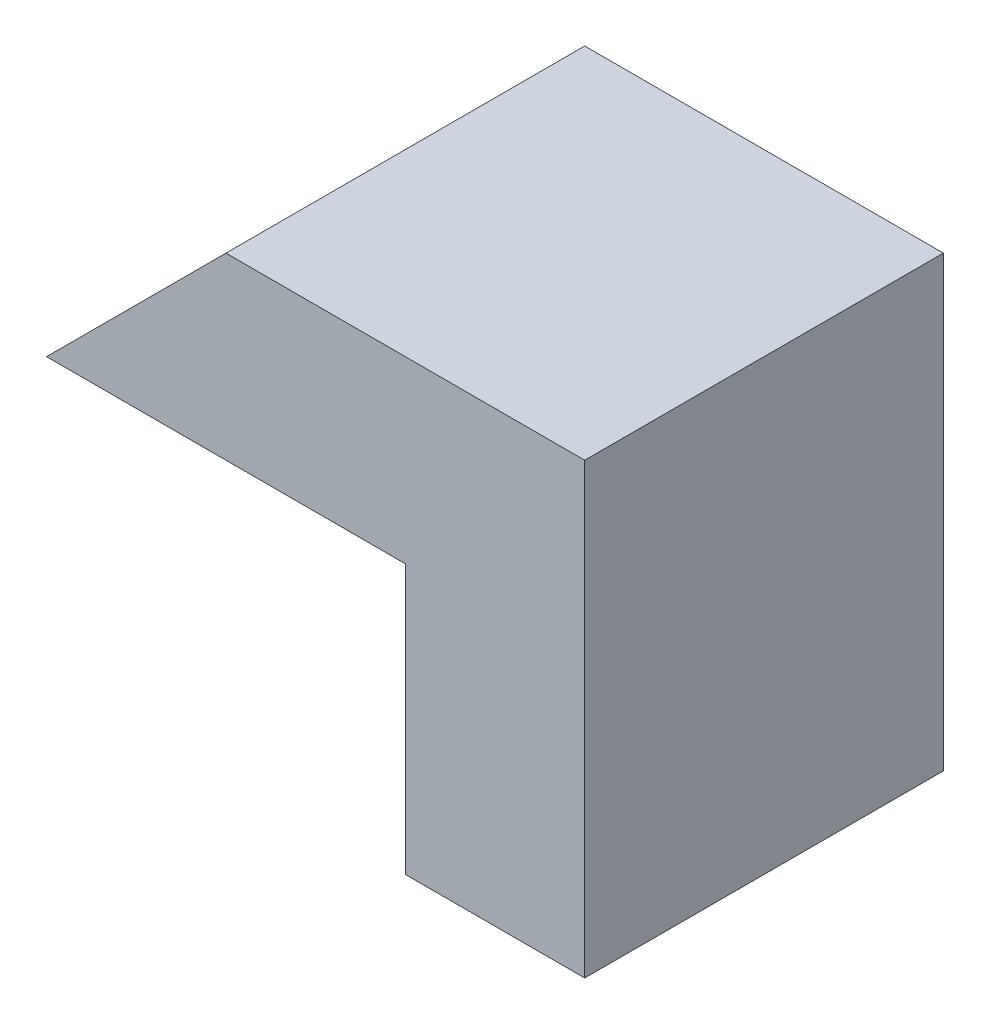
ISO-10303-21;
HEADER;
FILE_DESCRIPTION(('STEP AP214'),'2;1');
FILE_NAME('part.step','',(''),(''),'','','');
FILE_SCHEMA(('AUTOMOTIVE_DESIGN { 1 0 10303 214 1 1 1 1 }'));
ENDSEC;
DATA;
#1=APPLICATION_CONTEXT('core data for automotive mechanical design processes');
#2=APPLICATION_PROTOCOL_DEFINITION('international standard','automotive_design',2000,#1);
#3=PRODUCT_CONTEXT('',#1,'mechanical');
#4=PRODUCT('Part','Part','',(#3));
#5=PRODUCT_RELATED_PRODUCT_CATEGORY('part','',(#4));
#6=PRODUCT_DEFINITION_FORMATION('','',#4);
#7=PRODUCT_DEFINITION_CONTEXT('part definition',#1,'design');
#8=PRODUCT_DEFINITION('design','',#6,#7);
#9=PRODUCT_DEFINITION_SHAPE('','',#8);
#10=(LENGTH_UNIT() NAMED_UNIT(*) SI_UNIT(.MILLI.,.METRE.));
#11=(NAMED_UNIT(*) PLANE_ANGLE_UNIT() SI_UNIT($,.RADIAN.));
#12=(NAMED_UNIT(*) SI_UNIT($,.STERADIAN.) SOLID_ANGLE_UNIT());
#13=UNCERTAINTY_MEASURE_WITH_UNIT(LENGTH_MEASURE(1.E-05),#10,'distance_accuracy_value','');
#14=(GEOMETRIC_REPRESENTATION_CONTEXT(3) GLOBAL_UNCERTAINTY_ASSIGNED_CONTEXT((#13)) GLOBAL_UNIT_ASSIGNED_CONTEXT((#10,
#11,#12)) REPRESENTATION_CONTEXT('',''));
#15=CARTESIAN_POINT('',(0.,0.,0.));
#16=DIRECTION('',(0.,0.,1.));
#17=DIRECTION('',(1.,0.,0.));
#18=AXIS2_PLACEMENT_3D('',#15,#16,#17);
#19=CARTESIAN_POINT('',(0.,5.,0.));
#20=DIRECTION('',(0.,0.,-1.));
#21=DIRECTION('',(-1.,0.,0.));
#22=AXIS2_PLACEMENT_3D('',#19,#20,#21);
#23=PLANE('',#22);
#24=DIRECTION('',(1.,0.,0.));
#25=VECTOR('',#24,1.);
#26=CARTESIAN_POINT('',(0.,3.,0.));
#27=LINE('',#26,#25);
#28=CARTESIAN_POINT('',(0.,3.,0.));
#29=VERTEX_POINT('',#28);
#30=CARTESIAN_POINT('',(4.,3.,0.));
#31=VERTEX_POINT('',#30);
#32=EDGE_CURVE('E111',#29,#31,#27,.T.);
#33=ORIENTED_EDGE('',*,*,#32,.T.);
#34=DIRECTION('',(0.,-1.,0.));
#35=VECTOR('',#34,1.);
#36=CARTESIAN_POINT('',(4.,3.,0.));
#37=LINE('',#36,#35);
#38=CARTESIAN_POINT('',(4.,0.,0.));
#39=VERTEX_POINT('',#38);
#40=EDGE_CURVE('E114',#31,#39,#37,.T.);
#41=ORIENTED_EDGE('',*,*,#40,.T.);
#42=DIRECTION('',(1.,0.,0.));
#43=VECTOR('',#42,1.);
#44=CARTESIAN_POINT('',(0.,0.,0.));
#45=LINE('',#44,#43);
#46=CARTESIAN_POINT('',(6.,0.,0.));
#47=VERTEX_POINT('',#46);
#48=EDGE_CURVE('E78',#39,#47,#45,.T.);
#49=ORIENTED_EDGE('',*,*,#48,.T.);
#50=DIRECTION('',(0.,-1.,0.));
#51=VECTOR('',#50,1.);
#52=CARTESIAN_POINT('',(6.,5.,0.));
#53=LINE('',#52,#51);
#54=CARTESIAN_POINT('',(6.,5.,0.));
#55=VERTEX_POINT('',#54);
#56=EDGE_CURVE('E40',#55,#47,#53,.T.);
#57=ORIENTED_EDGE('',*,*,#56,.F.);
#58=DIRECTION('',(1.,0.,0.));
#59=VECTOR('',#58,1.);
#60=CARTESIAN_POINT('',(0.,5.,0.));
#61=LINE('',#60,#59);
#62=CARTESIAN_POINT('',(2.,5.,0.));
#63=VERTEX_POINT('',#62);
#64=EDGE_CURVE('E92',#63,#55,#61,.T.);
#65=ORIENTED_EDGE('',*,*,#64,.F.);
#66=DIRECTION('',(-0.707106781186548,-0.707106781186548,0.));
#67=VECTOR('',#66,1.);
#68=CARTESIAN_POINT('',(-1.5,1.5,0.));
#69=LINE('',#68,#67);
#70=EDGE_CURVE('E46',#63,#29,#69,.T.);
#71=ORIENTED_EDGE('',*,*,#70,.T.);
#72=EDGE_LOOP('',(#33,#41,#49,#57,#65,#71));
#73=FACE_BOUND('',#72,.T.);
#74=ADVANCED_FACE('F33',(#73),#23,.F.);
#75=CARTESIAN_POINT('',(0.,5.,-4.));
#76=DIRECTION('',(0.,0.,1.));
#77=DIRECTION('',(1.,0.,0.));
#78=AXIS2_PLACEMENT_3D('',#75,#76,#77);
#79=PLANE('',#78);
#80=DIRECTION('',(0.,-1.,0.));
#81=VECTOR('',#80,1.);
#82=CARTESIAN_POINT('',(1.,5.,-4.));
#83=LINE('',#82,#81);
#84=CARTESIAN_POINT('',(1.,3.,-4.));
#85=VERTEX_POINT('',#84);
#86=CARTESIAN_POINT('',(1.,0.,-4.));
#87=VERTEX_POINT('',#86);
#88=EDGE_CURVE('E105',#85,#87,#83,.T.);
#89=ORIENTED_EDGE('',*,*,#88,.F.);
#90=DIRECTION('',(1.,0.,0.));
#91=VECTOR('',#90,1.);
#92=CARTESIAN_POINT('',(0.,3.,-4.));
#93=LINE('',#92,#91);
#94=CARTESIAN_POINT('',(0.,3.,-4.));
#95=VERTEX_POINT('',#94);
#96=EDGE_CURVE('E108',#95,#85,#93,.T.);
#97=ORIENTED_EDGE('',*,*,#96,.F.);
#98=DIRECTION('',(-0.707106781186548,-0.707106781186548,0.));
#99=VECTOR('',#98,1.);
#100=CARTESIAN_POINT('',(1.,4.,-4.));
#101=LINE('',#100,#99);
#102=CARTESIAN_POINT('',(2.,5.,-4.));
#103=VERTEX_POINT('',#102);
#104=EDGE_CURVE('E97',#103,#95,#101,.T.);
#105=ORIENTED_EDGE('',*,*,#104,.F.);
#106=DIRECTION('',(-1.,0.,0.));
#107=VECTOR('',#106,1.);
#108=CARTESIAN_POINT('',(0.,5.,-4.));
#109=LINE('',#108,#107);
#110=CARTESIAN_POINT('',(6.,5.,-4.));
#111=VERTEX_POINT('',#110);
#112=EDGE_CURVE('E86',#111,#103,#109,.T.);
#113=ORIENTED_EDGE('',*,*,#112,.F.);
#114=DIRECTION('',(0.,-1.,0.));
#115=VECTOR('',#114,1.);
#116=CARTESIAN_POINT('',(6.,5.,-4.));
#117=LINE('',#116,#115);
#118=CARTESIAN_POINT('',(6.,0.,-4.));
#119=VERTEX_POINT('',#118);
#120=EDGE_CURVE('E71',#111,#119,#117,.T.);
#121=ORIENTED_EDGE('',*,*,#120,.T.);
#122=DIRECTION('',(-1.,0.,0.));
#123=VECTOR('',#122,1.);
#124=CARTESIAN_POINT('',(0.,0.,-4.));
#125=LINE('',#124,#123);
#126=EDGE_CURVE('E77',#119,#87,#125,.T.);
#127=ORIENTED_EDGE('',*,*,#126,.T.);
#128=EDGE_LOOP('',(#89,#97,#105,#113,#121,#127));
#129=FACE_BOUND('',#128,.T.);
#130=ADVANCED_FACE('F83',(#129),#79,.F.);
#131=CARTESIAN_POINT('',(0.,0.,0.));
#132=DIRECTION('',(0.,-1.,0.));
#133=DIRECTION('',(0.,0.,-1.));
#134=AXIS2_PLACEMENT_3D('',#131,#132,#133);
#135=PLANE('',#134);
#136=DIRECTION('',(0.6,0.,0.8));
#137=VECTOR('',#136,1.);
#138=CARTESIAN_POINT('',(1.,0.,-4.));
#139=LINE('',#138,#137);
#140=EDGE_CURVE('E91',#87,#39,#139,.T.);
#141=ORIENTED_EDGE('',*,*,#140,.F.);
#142=ORIENTED_EDGE('',*,*,#126,.F.);
#143=DIRECTION('',(0.,0.,-1.));
#144=VECTOR('',#143,1.);
#145=CARTESIAN_POINT('',(6.,0.,0.));
#146=LINE('',#145,#144);
#147=EDGE_CURVE('E68',#47,#119,#146,.T.);
#148=ORIENTED_EDGE('',*,*,#147,.F.);
#149=ORIENTED_EDGE('',*,*,#48,.F.);
#150=EDGE_LOOP('',(#141,#142,#148,#149));
#151=FACE_BOUND('',#150,.T.);
#152=ADVANCED_FACE('F89',(#151),#135,.T.);
#153=CARTESIAN_POINT('',(0.,5.,0.));
#154=DIRECTION('',(0.,-1.,0.));
#155=DIRECTION('',(0.,0.,-1.));
#156=AXIS2_PLACEMENT_3D('',#153,#154,#155);
#157=PLANE('',#156);
#158=DIRECTION('',(0.,0.,-1.));
#159=VECTOR('',#158,1.);
#160=CARTESIAN_POINT('',(2.,5.,0.));
#161=LINE('',#160,#159);
#162=EDGE_CURVE('E11',#63,#103,#161,.T.);
#163=ORIENTED_EDGE('',*,*,#162,.F.);
#164=ORIENTED_EDGE('',*,*,#64,.T.);
#165=DIRECTION('',(0.,0.,-1.));
#166=VECTOR('',#165,1.);
#167=CARTESIAN_POINT('',(6.,5.,0.));
#168=LINE('',#167,#166);
#169=EDGE_CURVE('E55',#55,#111,#168,.T.);
#170=ORIENTED_EDGE('',*,*,#169,.T.);
#171=ORIENTED_EDGE('',*,*,#112,.T.);
#172=EDGE_LOOP('',(#163,#164,#170,#171));
#173=FACE_BOUND('',#172,.T.);
#174=ADVANCED_FACE('F142',(#173),#157,.F.);
#175=CARTESIAN_POINT('',(6.,5.,0.));
#176=DIRECTION('',(-1.,0.,0.));
#177=DIRECTION('',(0.,0.,1.));
#178=AXIS2_PLACEMENT_3D('',#175,#176,#177);
#179=PLANE('',#178);
#180=ORIENTED_EDGE('',*,*,#147,.T.);
#181=ORIENTED_EDGE('',*,*,#120,.F.);
#182=ORIENTED_EDGE('',*,*,#169,.F.);
#183=ORIENTED_EDGE('',*,*,#56,.T.);
#184=EDGE_LOOP('',(#180,#181,#182,#183));
#185=FACE_BOUND('',#184,.T.);
#186=ADVANCED_FACE('F70',(#185),#179,.F.);
#187=CARTESIAN_POINT('',(-1.5,1.5,-5.));
#188=DIRECTION('',(-0.707106781186548,0.707106781186548,0.));
#189=DIRECTION('',(-0.707106781186548,-0.707106781186548,0.));
#190=AXIS2_PLACEMENT_3D('',#187,#188,#189);
#191=PLANE('',#190);
#192=ORIENTED_EDGE('',*,*,#104,.T.);
#193=DIRECTION('',(0.,0.,1.));
#194=VECTOR('',#193,1.);
#195=CARTESIAN_POINT('',(0.,3.,-5.));
#196=LINE('',#195,#194);
#197=EDGE_CURVE('E102',#95,#29,#196,.T.);
#198=ORIENTED_EDGE('',*,*,#197,.T.);
#199=ORIENTED_EDGE('',*,*,#70,.F.);
#200=ORIENTED_EDGE('',*,*,#162,.T.);
#201=EDGE_LOOP('',(#192,#198,#199,#200));
#202=FACE_BOUND('',#201,.T.);
#203=ADVANCED_FACE('F140',(#202),#191,.T.);
#204=CARTESIAN_POINT('',(0.,3.,-5.));
#205=DIRECTION('',(0.,-1.,0.));
#206=DIRECTION('',(0.,0.,-1.));
#207=AXIS2_PLACEMENT_3D('',#204,#205,#206);
#208=PLANE('',#207);
#209=ORIENTED_EDGE('',*,*,#96,.T.);
#210=DIRECTION('',(0.6,0.,0.8));
#211=VECTOR('',#210,1.);
#212=CARTESIAN_POINT('',(1.,3.,-4.));
#213=LINE('',#212,#211);
#214=EDGE_CURVE('E117',#85,#31,#213,.T.);
#215=ORIENTED_EDGE('',*,*,#214,.T.);
#216=ORIENTED_EDGE('',*,*,#32,.F.);
#217=ORIENTED_EDGE('',*,*,#197,.F.);
#218=EDGE_LOOP('',(#209,#215,#216,#217));
#219=FACE_BOUND('',#218,.T.);
#220=ADVANCED_FACE('F124',(#219),#208,.T.);
#221=CARTESIAN_POINT('',(1.,3.,-4.));
#222=DIRECTION('',(0.8,0.,-0.6));
#223=DIRECTION('',(-0.6,0.,-0.8));
#224=AXIS2_PLACEMENT_3D('',#221,#222,#223);
#225=PLANE('',#224);
#226=ORIENTED_EDGE('',*,*,#140,.T.);
#227=ORIENTED_EDGE('',*,*,#40,.F.);
#228=ORIENTED_EDGE('',*,*,#214,.F.);
#229=ORIENTED_EDGE('',*,*,#88,.T.);
#230=EDGE_LOOP('',(#226,#227,#228,#229));
#231=FACE_BOUND('',#230,.T.);
#232=ADVANCED_FACE('F133',(#231),#225,.F.);
#233=CLOSED_SHELL('',(#74,#130,#152,#174,#186,#203,#220,#232));
#234=MANIFOLD_SOLID_BREP('B2',#233);
#235=ADVANCED_BREP_SHAPE_REPRESENTATION('',(#18,#234),#14);
#236=SHAPE_DEFINITION_REPRESENTATION(#9,#235);
ENDSEC;
END-ISO-10303-21;
